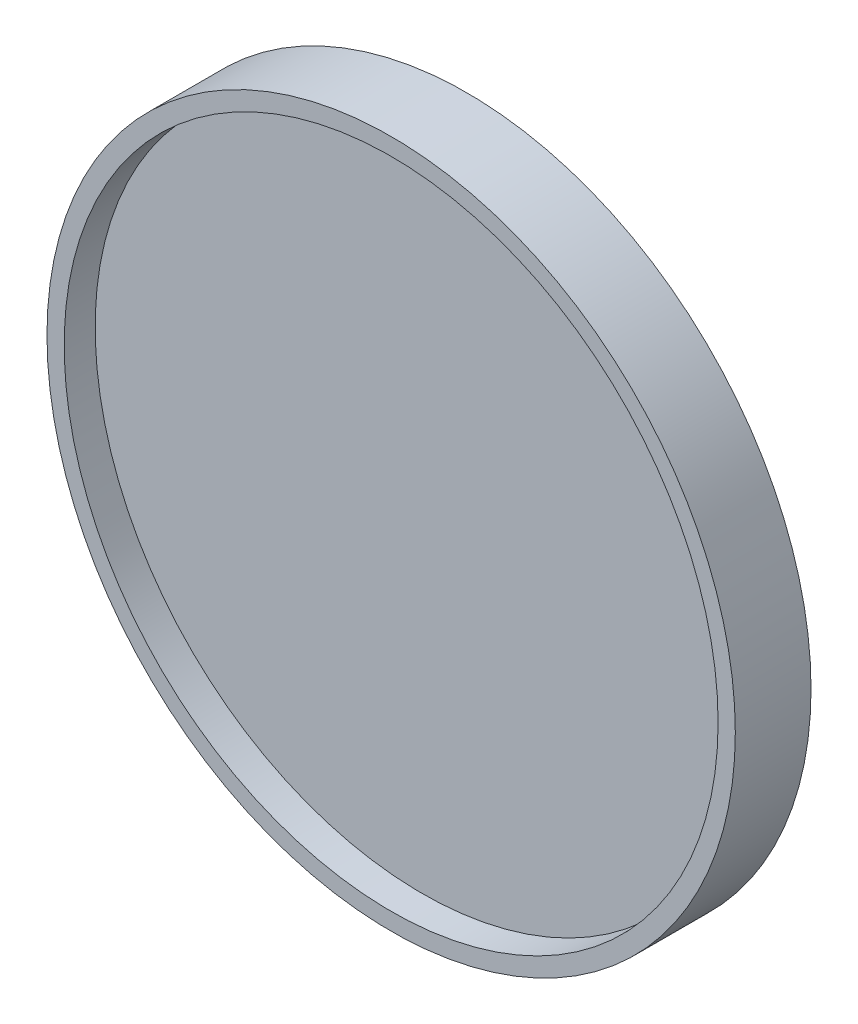
ISO-10303-21;
HEADER;
FILE_DESCRIPTION(('STEP AP214'),'2;1');
FILE_NAME('part.step','',(''),(''),'','','');
FILE_SCHEMA(('AUTOMOTIVE_DESIGN { 1 0 10303 214 1 1 1 1 }'));
ENDSEC;
DATA;
#1=APPLICATION_CONTEXT('core data for automotive mechanical design processes');
#2=APPLICATION_PROTOCOL_DEFINITION('international standard','automotive_design',2000,#1);
#3=PRODUCT_CONTEXT('',#1,'mechanical');
#4=PRODUCT('Part','Part','',(#3));
#5=PRODUCT_RELATED_PRODUCT_CATEGORY('part','',(#4));
#6=PRODUCT_DEFINITION_FORMATION('','',#4);
#7=PRODUCT_DEFINITION_CONTEXT('part definition',#1,'design');
#8=PRODUCT_DEFINITION('design','',#6,#7);
#9=PRODUCT_DEFINITION_SHAPE('','',#8);
#10=(LENGTH_UNIT() NAMED_UNIT(*) SI_UNIT(.MILLI.,.METRE.));
#11=(NAMED_UNIT(*) PLANE_ANGLE_UNIT() SI_UNIT($,.RADIAN.));
#12=(NAMED_UNIT(*) SI_UNIT($,.STERADIAN.) SOLID_ANGLE_UNIT());
#13=UNCERTAINTY_MEASURE_WITH_UNIT(LENGTH_MEASURE(1.E-05),#10,'distance_accuracy_value','');
#14=(GEOMETRIC_REPRESENTATION_CONTEXT(3) GLOBAL_UNCERTAINTY_ASSIGNED_CONTEXT((#13)) GLOBAL_UNIT_ASSIGNED_CONTEXT((#10,
#11,#12)) REPRESENTATION_CONTEXT('',''));
#15=CARTESIAN_POINT('',(0.,0.,0.));
#16=DIRECTION('',(0.,0.,1.));
#17=DIRECTION('',(1.,0.,0.));
#18=AXIS2_PLACEMENT_3D('',#15,#16,#17);
#19=CARTESIAN_POINT('',(0.,0.,2.75));
#20=DIRECTION('',(0.,0.,-1.));
#21=DIRECTION('',(-1.,0.,0.));
#22=AXIS2_PLACEMENT_3D('',#19,#20,#21);
#23=CYLINDRICAL_SURFACE('',#22,23.75);
#24=CARTESIAN_POINT('',(0.,0.,-2.75));
#25=DIRECTION('',(0.,0.,1.));
#26=DIRECTION('',(1.,0.,0.));
#27=AXIS2_PLACEMENT_3D('',#24,#25,#26);
#28=CIRCLE('',#27,23.75);
#29=CARTESIAN_POINT('',(23.75,0.,-2.75));
#30=VERTEX_POINT('',#29);
#31=EDGE_CURVE('E58',#30,#30,#28,.T.);
#32=ORIENTED_EDGE('',*,*,#31,.F.);
#33=EDGE_LOOP('',(#32));
#34=FACE_BOUND('',#33,.T.);
#35=CARTESIAN_POINT('',(0.,0.,-0.5));
#36=DIRECTION('',(0.,0.,1.));
#37=DIRECTION('',(1.,0.,0.));
#38=AXIS2_PLACEMENT_3D('',#35,#36,#37);
#39=CIRCLE('',#38,23.75);
#40=CARTESIAN_POINT('',(23.75,0.,-0.5));
#41=VERTEX_POINT('',#40);
#42=EDGE_CURVE('E62',#41,#41,#39,.T.);
#43=ORIENTED_EDGE('',*,*,#42,.T.);
#44=EDGE_LOOP('',(#43));
#45=FACE_BOUND('',#44,.T.);
#46=ADVANCED_FACE('F37',(#34,#45),#23,.F.);
#47=CARTESIAN_POINT('',(0.,0.,2.75));
#48=DIRECTION('',(0.,0.,1.));
#49=DIRECTION('',(1.,0.,0.));
#50=AXIS2_PLACEMENT_3D('',#47,#48,#49);
#51=PLANE('',#50);
#52=CARTESIAN_POINT('',(0.,0.,2.75));
#53=DIRECTION('',(0.,0.,1.));
#54=DIRECTION('',(1.,0.,0.));
#55=AXIS2_PLACEMENT_3D('',#52,#53,#54);
#56=CIRCLE('',#55,25.);
#57=CARTESIAN_POINT('',(25.,0.,2.75));
#58=VERTEX_POINT('',#57);
#59=EDGE_CURVE('E45',#58,#58,#56,.T.);
#60=ORIENTED_EDGE('',*,*,#59,.T.);
#61=EDGE_LOOP('',(#60));
#62=FACE_BOUND('',#61,.T.);
#63=CARTESIAN_POINT('',(0.,0.,2.75));
#64=DIRECTION('',(0.,0.,1.));
#65=DIRECTION('',(1.,0.,0.));
#66=AXIS2_PLACEMENT_3D('',#63,#64,#65);
#67=CIRCLE('',#66,23.75);
#68=CARTESIAN_POINT('',(23.75,0.,2.75));
#69=VERTEX_POINT('',#68);
#70=EDGE_CURVE('E56',#69,#69,#67,.T.);
#71=ORIENTED_EDGE('',*,*,#70,.F.);
#72=EDGE_LOOP('',(#71));
#73=FACE_BOUND('',#72,.T.);
#74=ADVANCED_FACE('F84',(#62,#73),#51,.T.);
#75=CARTESIAN_POINT('',(0.,0.,-2.75));
#76=DIRECTION('',(0.,0.,1.));
#77=DIRECTION('',(1.,0.,0.));
#78=AXIS2_PLACEMENT_3D('',#75,#76,#77);
#79=PLANE('',#78);
#80=CARTESIAN_POINT('',(0.,0.,-2.75));
#81=DIRECTION('',(0.,0.,1.));
#82=DIRECTION('',(1.,0.,0.));
#83=AXIS2_PLACEMENT_3D('',#80,#81,#82);
#84=CIRCLE('',#83,25.);
#85=CARTESIAN_POINT('',(25.,0.,-2.75));
#86=VERTEX_POINT('',#85);
#87=EDGE_CURVE('E50',#86,#86,#84,.T.);
#88=ORIENTED_EDGE('',*,*,#87,.F.);
#89=EDGE_LOOP('',(#88));
#90=FACE_BOUND('',#89,.T.);
#91=ORIENTED_EDGE('',*,*,#31,.T.);
#92=EDGE_LOOP('',(#91));
#93=FACE_BOUND('',#92,.T.);
#94=ADVANCED_FACE('F89',(#90,#93),#79,.F.);
#95=CARTESIAN_POINT('',(0.,0.,2.75));
#96=DIRECTION('',(0.,0.,-1.));
#97=DIRECTION('',(-1.,0.,0.));
#98=AXIS2_PLACEMENT_3D('',#95,#96,#97);
#99=CYLINDRICAL_SURFACE('',#98,25.);
#100=ORIENTED_EDGE('',*,*,#59,.F.);
#101=EDGE_LOOP('',(#100));
#102=FACE_BOUND('',#101,.T.);
#103=ORIENTED_EDGE('',*,*,#87,.T.);
#104=EDGE_LOOP('',(#103));
#105=FACE_BOUND('',#104,.T.);
#106=ADVANCED_FACE('F39',(#102,#105),#99,.T.);
#107=CARTESIAN_POINT('',(0.,0.,0.5));
#108=DIRECTION('',(0.,0.,1.));
#109=DIRECTION('',(1.,0.,0.));
#110=AXIS2_PLACEMENT_3D('',#107,#108,#109);
#111=CIRCLE('',#110,23.75);
#112=CARTESIAN_POINT('',(23.75,0.,0.5));
#113=VERTEX_POINT('',#112);
#114=EDGE_CURVE('E10',#113,#113,#111,.T.);
#115=ORIENTED_EDGE('',*,*,#114,.F.);
#116=EDGE_LOOP('',(#115));
#117=FACE_BOUND('',#116,.T.);
#118=ORIENTED_EDGE('',*,*,#70,.T.);
#119=EDGE_LOOP('',(#118));
#120=FACE_BOUND('',#119,.T.);
#121=ADVANCED_FACE('F74',(#117,#120),#23,.F.);
#122=CARTESIAN_POINT('',(0.,0.,-0.5));
#123=DIRECTION('',(0.,0.,1.));
#124=DIRECTION('',(1.,0.,0.));
#125=AXIS2_PLACEMENT_3D('',#122,#123,#124);
#126=PLANE('',#125);
#127=ORIENTED_EDGE('',*,*,#42,.F.);
#128=EDGE_LOOP('',(#127));
#129=FACE_BOUND('',#128,.T.);
#130=ADVANCED_FACE('F71',(#129),#126,.F.);
#131=CARTESIAN_POINT('',(0.,0.,0.5));
#132=DIRECTION('',(0.,0.,1.));
#133=DIRECTION('',(1.,0.,0.));
#134=AXIS2_PLACEMENT_3D('',#131,#132,#133);
#135=PLANE('',#134);
#136=ORIENTED_EDGE('',*,*,#114,.T.);
#137=EDGE_LOOP('',(#136));
#138=FACE_BOUND('',#137,.T.);
#139=ADVANCED_FACE('F73',(#138),#135,.T.);
#140=CLOSED_SHELL('',(#46,#74,#94,#106,#121,#130,#139));
#141=MANIFOLD_SOLID_BREP('B2',#140);
#142=ADVANCED_BREP_SHAPE_REPRESENTATION('',(#18,#141),#14);
#143=SHAPE_DEFINITION_REPRESENTATION(#9,#142);
ENDSEC;
END-ISO-10303-21;
